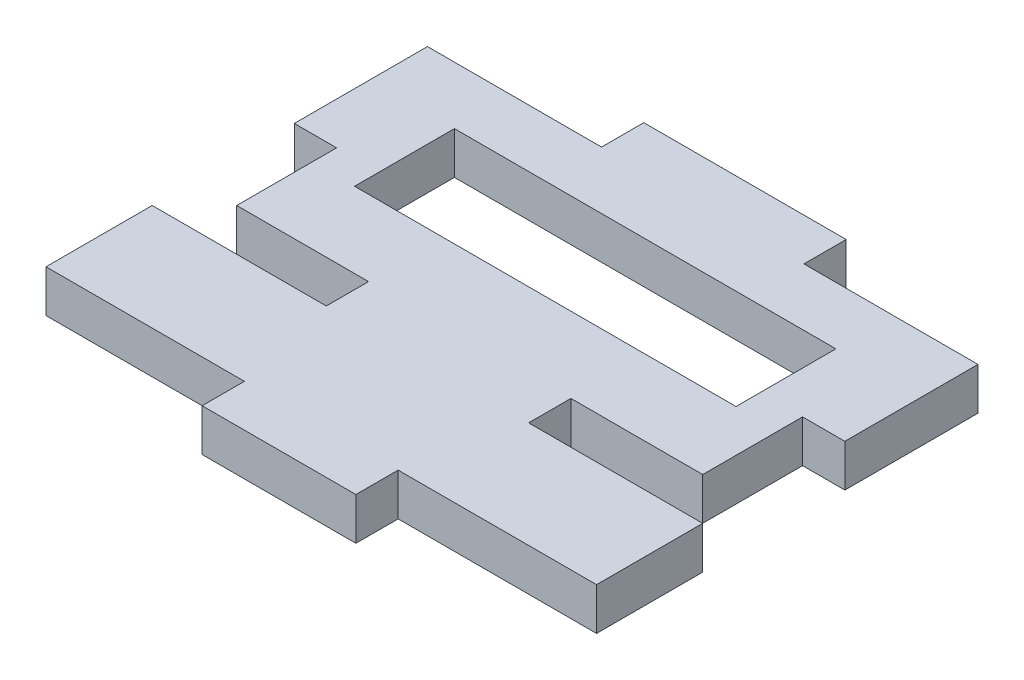
ISO-10303-21;
HEADER;
FILE_DESCRIPTION(('STEP AP214'),'2;1');
FILE_NAME('part.step','',(''),(''),'','','');
FILE_SCHEMA(('AUTOMOTIVE_DESIGN { 1 0 10303 214 1 1 1 1 }'));
ENDSEC;
DATA;
#1=APPLICATION_CONTEXT('core data for automotive mechanical design processes');
#2=APPLICATION_PROTOCOL_DEFINITION('international standard','automotive_design',2000,#1);
#3=PRODUCT_CONTEXT('',#1,'mechanical');
#4=PRODUCT('Part','Part','',(#3));
#5=PRODUCT_RELATED_PRODUCT_CATEGORY('part','',(#4));
#6=PRODUCT_DEFINITION_FORMATION('','',#4);
#7=PRODUCT_DEFINITION_CONTEXT('part definition',#1,'design');
#8=PRODUCT_DEFINITION('design','',#6,#7);
#9=PRODUCT_DEFINITION_SHAPE('','',#8);
#10=(LENGTH_UNIT() NAMED_UNIT(*) SI_UNIT(.MILLI.,.METRE.));
#11=(NAMED_UNIT(*) PLANE_ANGLE_UNIT() SI_UNIT($,.RADIAN.));
#12=(NAMED_UNIT(*) SI_UNIT($,.STERADIAN.) SOLID_ANGLE_UNIT());
#13=UNCERTAINTY_MEASURE_WITH_UNIT(LENGTH_MEASURE(1.E-05),#10,'distance_accuracy_value','');
#14=(GEOMETRIC_REPRESENTATION_CONTEXT(3) GLOBAL_UNCERTAINTY_ASSIGNED_CONTEXT((#13)) GLOBAL_UNIT_ASSIGNED_CONTEXT((#10,
#11,#12)) REPRESENTATION_CONTEXT('',''));
#15=CARTESIAN_POINT('',(0.,0.,0.));
#16=DIRECTION('',(0.,0.,1.));
#17=DIRECTION('',(1.,0.,0.));
#18=AXIS2_PLACEMENT_3D('',#15,#16,#17);
#19=CARTESIAN_POINT('',(0.,3.175,0.));
#20=DIRECTION('',(1.,0.,0.));
#21=DIRECTION('',(0.,0.,-1.));
#22=AXIS2_PLACEMENT_3D('',#19,#20,#21);
#23=PLANE('',#22);
#24=DIRECTION('',(0.,0.,1.));
#25=VECTOR('',#24,1.);
#26=CARTESIAN_POINT('',(0.,3.175,0.));
#27=LINE('',#26,#25);
#28=CARTESIAN_POINT('',(0.,3.175,-11.1499999999999));
#29=VERTEX_POINT('',#28);
#30=CARTESIAN_POINT('',(0.,3.175,-3.17500000000007));
#31=VERTEX_POINT('',#30);
#32=EDGE_CURVE('E414',#29,#31,#27,.T.);
#33=ORIENTED_EDGE('',*,*,#32,.F.);
#34=DIRECTION('',(0.,1.,0.));
#35=VECTOR('',#34,1.);
#36=CARTESIAN_POINT('',(0.,0.,-11.1499999999999));
#37=LINE('',#36,#35);
#38=CARTESIAN_POINT('',(0.,0.,-11.1499999999999));
#39=VERTEX_POINT('',#38);
#40=EDGE_CURVE('E318',#39,#29,#37,.T.);
#41=ORIENTED_EDGE('',*,*,#40,.F.);
#42=DIRECTION('',(0.,0.,1.));
#43=VECTOR('',#42,1.);
#44=CARTESIAN_POINT('',(0.,0.,0.));
#45=LINE('',#44,#43);
#46=CARTESIAN_POINT('',(0.,0.,-3.17500000000007));
#47=VERTEX_POINT('',#46);
#48=EDGE_CURVE('E407',#39,#47,#45,.T.);
#49=ORIENTED_EDGE('',*,*,#48,.T.);
#50=DIRECTION('',(0.,1.,0.));
#51=VECTOR('',#50,1.);
#52=CARTESIAN_POINT('',(0.,0.,-3.17500000000007));
#53=LINE('',#52,#51);
#54=EDGE_CURVE('E285',#47,#31,#53,.T.);
#55=ORIENTED_EDGE('',*,*,#54,.T.);
#56=EDGE_LOOP('',(#33,#41,#49,#55));
#57=FACE_BOUND('',#56,.T.);
#58=ADVANCED_FACE('F32',(#57),#23,.F.);
#59=CARTESIAN_POINT('',(41.35,3.175,0.));
#60=DIRECTION('',(-1.,0.,0.));
#61=DIRECTION('',(0.,0.,1.));
#62=AXIS2_PLACEMENT_3D('',#59,#60,#61);
#63=PLANE('',#62);
#64=DIRECTION('',(0.,0.,-1.));
#65=VECTOR('',#64,1.);
#66=CARTESIAN_POINT('',(41.35,3.175,0.));
#67=LINE('',#66,#65);
#68=CARTESIAN_POINT('',(41.35,3.175,-21.8250000000001));
#69=VERTEX_POINT('',#68);
#70=CARTESIAN_POINT('',(41.35,3.175,-31.825));
#71=VERTEX_POINT('',#70);
#72=EDGE_CURVE('E421',#69,#71,#67,.T.);
#73=ORIENTED_EDGE('',*,*,#72,.F.);
#74=DIRECTION('',(0.,1.,0.));
#75=VECTOR('',#74,1.);
#76=CARTESIAN_POINT('',(41.35,0.,-21.8250000000001));
#77=LINE('',#76,#75);
#78=CARTESIAN_POINT('',(41.35,0.,-21.8250000000001));
#79=VERTEX_POINT('',#78);
#80=EDGE_CURVE('E264',#79,#69,#77,.T.);
#81=ORIENTED_EDGE('',*,*,#80,.F.);
#82=DIRECTION('',(0.,0.,-1.));
#83=VECTOR('',#82,1.);
#84=CARTESIAN_POINT('',(41.35,0.,0.));
#85=LINE('',#84,#83);
#86=CARTESIAN_POINT('',(41.35,0.,-31.825));
#87=VERTEX_POINT('',#86);
#88=EDGE_CURVE('E429',#79,#87,#85,.T.);
#89=ORIENTED_EDGE('',*,*,#88,.T.);
#90=DIRECTION('',(0.,1.,0.));
#91=VECTOR('',#90,1.);
#92=CARTESIAN_POINT('',(41.35,0.,-31.825));
#93=LINE('',#92,#91);
#94=EDGE_CURVE('E362',#87,#71,#93,.T.);
#95=ORIENTED_EDGE('',*,*,#94,.T.);
#96=EDGE_LOOP('',(#73,#81,#89,#95));
#97=FACE_BOUND('',#96,.T.);
#98=ADVANCED_FACE('F466',(#97),#63,.F.);
#99=CARTESIAN_POINT('',(0.,0.,-31.825));
#100=VERTEX_POINT('',#99);
#101=CARTESIAN_POINT('',(0.,0.,-21.825));
#102=VERTEX_POINT('',#101);
#103=EDGE_CURVE('E426',#100,#102,#45,.T.);
#104=ORIENTED_EDGE('',*,*,#103,.T.);
#105=DIRECTION('',(0.,1.,0.));
#106=VECTOR('',#105,1.);
#107=CARTESIAN_POINT('',(0.,0.,-21.825));
#108=LINE('',#107,#106);
#109=CARTESIAN_POINT('',(0.,3.175,-21.825));
#110=VERTEX_POINT('',#109);
#111=EDGE_CURVE('E320',#102,#110,#108,.T.);
#112=ORIENTED_EDGE('',*,*,#111,.T.);
#113=CARTESIAN_POINT('',(0.,3.175,-31.825));
#114=VERTEX_POINT('',#113);
#115=EDGE_CURVE('E417',#114,#110,#27,.T.);
#116=ORIENTED_EDGE('',*,*,#115,.F.);
#117=DIRECTION('',(0.,1.,0.));
#118=VECTOR('',#117,1.);
#119=CARTESIAN_POINT('',(0.,0.,-31.825));
#120=LINE('',#119,#118);
#121=EDGE_CURVE('E335',#100,#114,#120,.T.);
#122=ORIENTED_EDGE('',*,*,#121,.F.);
#123=EDGE_LOOP('',(#104,#112,#116,#122));
#124=FACE_BOUND('',#123,.T.);
#125=ADVANCED_FACE('F34',(#124),#23,.F.);
#126=CARTESIAN_POINT('',(0.,3.175,0.));
#127=DIRECTION('',(0.,0.,-1.));
#128=DIRECTION('',(-1.,0.,0.));
#129=AXIS2_PLACEMENT_3D('',#126,#127,#128);
#130=PLANE('',#129);
#131=DIRECTION('',(1.,0.,0.));
#132=VECTOR('',#131,1.);
#133=CARTESIAN_POINT('',(0.,3.175,0.));
#134=LINE('',#133,#132);
#135=CARTESIAN_POINT('',(14.9,3.175,0.));
#136=VERTEX_POINT('',#135);
#137=CARTESIAN_POINT('',(26.45,3.175,0.));
#138=VERTEX_POINT('',#137);
#139=EDGE_CURVE('E418',#136,#138,#134,.T.);
#140=ORIENTED_EDGE('',*,*,#139,.F.);
#141=DIRECTION('',(0.,1.,0.));
#142=VECTOR('',#141,1.);
#143=CARTESIAN_POINT('',(14.9,0.,0.));
#144=LINE('',#143,#142);
#145=CARTESIAN_POINT('',(14.9,0.,0.));
#146=VERTEX_POINT('',#145);
#147=EDGE_CURVE('E255',#146,#136,#144,.T.);
#148=ORIENTED_EDGE('',*,*,#147,.F.);
#149=DIRECTION('',(1.,0.,0.));
#150=VECTOR('',#149,1.);
#151=CARTESIAN_POINT('',(0.,0.,0.));
#152=LINE('',#151,#150);
#153=CARTESIAN_POINT('',(26.45,0.,0.));
#154=VERTEX_POINT('',#153);
#155=EDGE_CURVE('E427',#146,#154,#152,.T.);
#156=ORIENTED_EDGE('',*,*,#155,.T.);
#157=DIRECTION('',(0.,1.,0.));
#158=VECTOR('',#157,1.);
#159=CARTESIAN_POINT('',(26.45,0.,0.));
#160=LINE('',#159,#158);
#161=EDGE_CURVE('E359',#154,#138,#160,.T.);
#162=ORIENTED_EDGE('',*,*,#161,.T.);
#163=EDGE_LOOP('',(#140,#148,#156,#162));
#164=FACE_BOUND('',#163,.T.);
#165=ADVANCED_FACE('F491',(#164),#130,.F.);
#166=CARTESIAN_POINT('',(41.35,0.,-3.17500000000007));
#167=VERTEX_POINT('',#166);
#168=CARTESIAN_POINT('',(41.35,0.,-11.15));
#169=VERTEX_POINT('',#168);
#170=EDGE_CURVE('E431',#167,#169,#85,.T.);
#171=ORIENTED_EDGE('',*,*,#170,.T.);
#172=DIRECTION('',(0.,1.,0.));
#173=VECTOR('',#172,1.);
#174=CARTESIAN_POINT('',(41.35,0.,-11.15));
#175=LINE('',#174,#173);
#176=CARTESIAN_POINT('',(41.35,3.175,-11.15));
#177=VERTEX_POINT('',#176);
#178=EDGE_CURVE('E266',#169,#177,#175,.T.);
#179=ORIENTED_EDGE('',*,*,#178,.T.);
#180=CARTESIAN_POINT('',(41.35,3.175,-3.17500000000007));
#181=VERTEX_POINT('',#180);
#182=EDGE_CURVE('E41',#181,#177,#67,.T.);
#183=ORIENTED_EDGE('',*,*,#182,.F.);
#184=DIRECTION('',(0.,1.,0.));
#185=VECTOR('',#184,1.);
#186=CARTESIAN_POINT('',(41.35,0.,-3.17500000000007));
#187=LINE('',#186,#185);
#188=EDGE_CURVE('E373',#167,#181,#187,.T.);
#189=ORIENTED_EDGE('',*,*,#188,.F.);
#190=EDGE_LOOP('',(#171,#179,#183,#189));
#191=FACE_BOUND('',#190,.T.);
#192=ADVANCED_FACE('F488',(#191),#63,.F.);
#193=CARTESIAN_POINT('',(0.,3.175,-35.));
#194=DIRECTION('',(0.,0.,1.));
#195=DIRECTION('',(1.,0.,0.));
#196=AXIS2_PLACEMENT_3D('',#193,#194,#195);
#197=PLANE('',#196);
#198=DIRECTION('',(-1.,0.,0.));
#199=VECTOR('',#198,1.);
#200=CARTESIAN_POINT('',(0.,3.175,-35.));
#201=LINE('',#200,#199);
#202=CARTESIAN_POINT('',(28.275,3.175,-35.));
#203=VERTEX_POINT('',#202);
#204=CARTESIAN_POINT('',(13.075,3.175,-35.));
#205=VERTEX_POINT('',#204);
#206=EDGE_CURVE('E11',#203,#205,#201,.T.);
#207=ORIENTED_EDGE('',*,*,#206,.F.);
#208=DIRECTION('',(0.,1.,0.));
#209=VECTOR('',#208,1.);
#210=CARTESIAN_POINT('',(28.275,0.,-35.));
#211=LINE('',#210,#209);
#212=CARTESIAN_POINT('',(28.275,0.,-35.));
#213=VERTEX_POINT('',#212);
#214=EDGE_CURVE('E339',#213,#203,#211,.T.);
#215=ORIENTED_EDGE('',*,*,#214,.F.);
#216=DIRECTION('',(-1.,0.,0.));
#217=VECTOR('',#216,1.);
#218=CARTESIAN_POINT('',(0.,0.,-35.));
#219=LINE('',#218,#217);
#220=CARTESIAN_POINT('',(13.075,0.,-35.));
#221=VERTEX_POINT('',#220);
#222=EDGE_CURVE('E36',#213,#221,#219,.T.);
#223=ORIENTED_EDGE('',*,*,#222,.T.);
#224=DIRECTION('',(0.,1.,0.));
#225=VECTOR('',#224,1.);
#226=CARTESIAN_POINT('',(13.075,0.,-35.));
#227=LINE('',#226,#225);
#228=EDGE_CURVE('E341',#221,#205,#227,.T.);
#229=ORIENTED_EDGE('',*,*,#228,.T.);
#230=EDGE_LOOP('',(#207,#215,#223,#229));
#231=FACE_BOUND('',#230,.T.);
#232=ADVANCED_FACE('F443',(#231),#197,.F.);
#233=CARTESIAN_POINT('',(0.,3.175,0.));
#234=DIRECTION('',(0.,-1.,0.));
#235=DIRECTION('',(0.,0.,-1.));
#236=AXIS2_PLACEMENT_3D('',#233,#234,#235);
#237=PLANE('',#236);
#238=DIRECTION('',(-1.,0.,0.));
#239=VECTOR('',#238,1.);
#240=CARTESIAN_POINT('',(35.,3.175,-27.5));
#241=LINE('',#240,#239);
#242=CARTESIAN_POINT('',(35.,3.175,-27.5));
#243=VERTEX_POINT('',#242);
#244=CARTESIAN_POINT('',(6.35,3.175,-27.5));
#245=VERTEX_POINT('',#244);
#246=EDGE_CURVE('E397',#243,#245,#241,.T.);
#247=ORIENTED_EDGE('',*,*,#246,.F.);
#248=DIRECTION('',(0.,0.,-1.));
#249=VECTOR('',#248,1.);
#250=CARTESIAN_POINT('',(35.,3.175,-27.5));
#251=LINE('',#250,#249);
#252=CARTESIAN_POINT('',(35.,3.175,-20.));
#253=VERTEX_POINT('',#252);
#254=EDGE_CURVE('E344',#253,#243,#251,.T.);
#255=ORIENTED_EDGE('',*,*,#254,.F.);
#256=DIRECTION('',(1.,0.,0.));
#257=VECTOR('',#256,1.);
#258=CARTESIAN_POINT('',(35.,3.175,-20.));
#259=LINE('',#258,#257);
#260=CARTESIAN_POINT('',(6.35,3.175,-20.));
#261=VERTEX_POINT('',#260);
#262=EDGE_CURVE('E386',#261,#253,#259,.T.);
#263=ORIENTED_EDGE('',*,*,#262,.F.);
#264=DIRECTION('',(0.,0.,1.));
#265=VECTOR('',#264,1.);
#266=CARTESIAN_POINT('',(6.35,3.175,-27.5));
#267=LINE('',#266,#265);
#268=EDGE_CURVE('E400',#245,#261,#267,.T.);
#269=ORIENTED_EDGE('',*,*,#268,.F.);
#270=EDGE_LOOP('',(#247,#255,#263,#269));
#271=FACE_BOUND('',#270,.T.);
#272=DIRECTION('',(0.,0.,-1.));
#273=VECTOR('',#272,1.);
#274=CARTESIAN_POINT('',(13.075,3.175,-14.3249999999998));
#275=LINE('',#274,#273);
#276=CARTESIAN_POINT('',(13.075,3.175,-11.1499999999998));
#277=VERTEX_POINT('',#276);
#278=CARTESIAN_POINT('',(13.075,3.175,-14.3249999999998));
#279=VERTEX_POINT('',#278);
#280=EDGE_CURVE('E263',#277,#279,#275,.T.);
#281=ORIENTED_EDGE('',*,*,#280,.F.);
#282=DIRECTION('',(1.,0.,0.));
#283=VECTOR('',#282,1.);
#284=CARTESIAN_POINT('',(13.075,3.175,-11.1499999999998));
#285=LINE('',#284,#283);
#286=EDGE_CURVE('E293',#29,#277,#285,.T.);
#287=ORIENTED_EDGE('',*,*,#286,.F.);
#288=ORIENTED_EDGE('',*,*,#32,.T.);
#289=DIRECTION('',(-1.,0.,0.));
#290=VECTOR('',#289,1.);
#291=CARTESIAN_POINT('',(14.9,3.175,-3.17500000000007));
#292=LINE('',#291,#290);
#293=CARTESIAN_POINT('',(14.9,3.175,-3.17500000000007));
#294=VERTEX_POINT('',#293);
#295=EDGE_CURVE('E276',#294,#31,#292,.T.);
#296=ORIENTED_EDGE('',*,*,#295,.F.);
#297=DIRECTION('',(0.,0.,-1.));
#298=VECTOR('',#297,1.);
#299=CARTESIAN_POINT('',(14.9,3.175,-3.17500000000007));
#300=LINE('',#299,#298);
#301=EDGE_CURVE('E280',#136,#294,#300,.T.);
#302=ORIENTED_EDGE('',*,*,#301,.F.);
#303=ORIENTED_EDGE('',*,*,#139,.T.);
#304=DIRECTION('',(0.,0.,1.));
#305=VECTOR('',#304,1.);
#306=CARTESIAN_POINT('',(26.45,3.175,0.));
#307=LINE('',#306,#305);
#308=CARTESIAN_POINT('',(26.45,3.175,-3.17500000000007));
#309=VERTEX_POINT('',#308);
#310=EDGE_CURVE('E370',#309,#138,#307,.T.);
#311=ORIENTED_EDGE('',*,*,#310,.F.);
#312=DIRECTION('',(-1.,0.,0.));
#313=VECTOR('',#312,1.);
#314=CARTESIAN_POINT('',(41.35,3.175,-3.17500000000007));
#315=LINE('',#314,#313);
#316=EDGE_CURVE('E317',#181,#309,#315,.T.);
#317=ORIENTED_EDGE('',*,*,#316,.F.);
#318=ORIENTED_EDGE('',*,*,#182,.T.);
#319=DIRECTION('',(1.,0.,0.));
#320=VECTOR('',#319,1.);
#321=CARTESIAN_POINT('',(28.275,3.175,-11.1499999999999));
#322=LINE('',#321,#320);
#323=CARTESIAN_POINT('',(28.275,3.175,-11.1499999999999));
#324=VERTEX_POINT('',#323);
#325=EDGE_CURVE('E245',#324,#177,#322,.T.);
#326=ORIENTED_EDGE('',*,*,#325,.F.);
#327=DIRECTION('',(0.,0.,1.));
#328=VECTOR('',#327,1.);
#329=CARTESIAN_POINT('',(28.275,3.175,-14.3249999999998));
#330=LINE('',#329,#328);
#331=CARTESIAN_POINT('',(28.275,3.175,-14.3249999999998));
#332=VERTEX_POINT('',#331);
#333=EDGE_CURVE('E257',#332,#324,#330,.T.);
#334=ORIENTED_EDGE('',*,*,#333,.F.);
#335=DIRECTION('',(-1.,0.,0.));
#336=VECTOR('',#335,1.);
#337=CARTESIAN_POINT('',(38.1750000000003,3.175,-14.3249999999999));
#338=LINE('',#337,#336);
#339=CARTESIAN_POINT('',(38.1750000000003,3.175,-14.3249999999999));
#340=VERTEX_POINT('',#339);
#341=EDGE_CURVE('E254',#340,#332,#338,.T.);
#342=ORIENTED_EDGE('',*,*,#341,.F.);
#343=DIRECTION('',(0.,0.,1.));
#344=VECTOR('',#343,1.);
#345=CARTESIAN_POINT('',(38.1750000000003,3.175,-21.8250000000001));
#346=LINE('',#345,#344);
#347=CARTESIAN_POINT('',(38.1750000000003,3.175,-21.8250000000001));
#348=VERTEX_POINT('',#347);
#349=EDGE_CURVE('E226',#348,#340,#346,.T.);
#350=ORIENTED_EDGE('',*,*,#349,.F.);
#351=DIRECTION('',(-1.,0.,0.));
#352=VECTOR('',#351,1.);
#353=CARTESIAN_POINT('',(38.1750000000003,3.175,-21.8250000000001));
#354=LINE('',#353,#352);
#355=EDGE_CURVE('E242',#69,#348,#354,.T.);
#356=ORIENTED_EDGE('',*,*,#355,.F.);
#357=ORIENTED_EDGE('',*,*,#72,.T.);
#358=DIRECTION('',(1.,0.,0.));
#359=VECTOR('',#358,1.);
#360=CARTESIAN_POINT('',(28.275,3.175,-31.825));
#361=LINE('',#360,#359);
#362=CARTESIAN_POINT('',(28.275,3.175,-31.825));
#363=VERTEX_POINT('',#362);
#364=EDGE_CURVE('E352',#363,#71,#361,.T.);
#365=ORIENTED_EDGE('',*,*,#364,.F.);
#366=DIRECTION('',(0.,0.,1.));
#367=VECTOR('',#366,1.);
#368=CARTESIAN_POINT('',(28.275,3.175,-31.825));
#369=LINE('',#368,#367);
#370=EDGE_CURVE('E356',#203,#363,#369,.T.);
#371=ORIENTED_EDGE('',*,*,#370,.F.);
#372=ORIENTED_EDGE('',*,*,#206,.T.);
#373=DIRECTION('',(0.,0.,-1.));
#374=VECTOR('',#373,1.);
#375=CARTESIAN_POINT('',(13.075,3.175,-35.));
#376=LINE('',#375,#374);
#377=CARTESIAN_POINT('',(13.075,3.175,-31.825));
#378=VERTEX_POINT('',#377);
#379=EDGE_CURVE('E332',#378,#205,#376,.T.);
#380=ORIENTED_EDGE('',*,*,#379,.F.);
#381=DIRECTION('',(1.,0.,0.));
#382=VECTOR('',#381,1.);
#383=CARTESIAN_POINT('',(0.,3.175,-31.825));
#384=LINE('',#383,#382);
#385=EDGE_CURVE('E336',#114,#378,#384,.T.);
#386=ORIENTED_EDGE('',*,*,#385,.F.);
#387=ORIENTED_EDGE('',*,*,#115,.T.);
#388=DIRECTION('',(-1.,0.,0.));
#389=VECTOR('',#388,1.);
#390=CARTESIAN_POINT('',(3.17500000000027,3.175,-21.825));
#391=LINE('',#390,#389);
#392=CARTESIAN_POINT('',(3.17500000000027,3.175,-21.825));
#393=VERTEX_POINT('',#392);
#394=EDGE_CURVE('E311',#393,#110,#391,.T.);
#395=ORIENTED_EDGE('',*,*,#394,.F.);
#396=DIRECTION('',(0.,0.,-1.));
#397=VECTOR('',#396,1.);
#398=CARTESIAN_POINT('',(3.17500000000027,3.175,-21.825));
#399=LINE('',#398,#397);
#400=CARTESIAN_POINT('',(3.17500000000033,3.175,-14.3249999999998));
#401=VERTEX_POINT('',#400);
#402=EDGE_CURVE('E308',#401,#393,#399,.T.);
#403=ORIENTED_EDGE('',*,*,#402,.F.);
#404=DIRECTION('',(-1.,0.,0.));
#405=VECTOR('',#404,1.);
#406=CARTESIAN_POINT('',(3.17500000000033,3.175,-14.3249999999998));
#407=LINE('',#406,#405);
#408=EDGE_CURVE('E305',#279,#401,#407,.T.);
#409=ORIENTED_EDGE('',*,*,#408,.F.);
#410=EDGE_LOOP('',(#281,#287,#288,#296,#302,#303,#311,#317,#318,#326,#334,#342,#350,#356,#357,
#365,#371,#372,#380,#386,#387,#395,#403,#409));
#411=FACE_BOUND('',#410,.T.);
#412=ADVANCED_FACE('F457',(#271,#411),#237,.F.);
#413=CARTESIAN_POINT('',(0.,0.,0.));
#414=DIRECTION('',(0.,-1.,0.));
#415=DIRECTION('',(0.,0.,-1.));
#416=AXIS2_PLACEMENT_3D('',#413,#414,#415);
#417=PLANE('',#416);
#418=DIRECTION('',(1.,0.,0.));
#419=VECTOR('',#418,1.);
#420=CARTESIAN_POINT('',(13.075,0.,-11.1499999999998));
#421=LINE('',#420,#419);
#422=CARTESIAN_POINT('',(13.075,0.,-11.1499999999998));
#423=VERTEX_POINT('',#422);
#424=EDGE_CURVE('E300',#39,#423,#421,.T.);
#425=ORIENTED_EDGE('',*,*,#424,.T.);
#426=DIRECTION('',(0.,0.,-1.));
#427=VECTOR('',#426,1.);
#428=CARTESIAN_POINT('',(13.075,0.,-14.3249999999998));
#429=LINE('',#428,#427);
#430=CARTESIAN_POINT('',(13.075,0.,-14.3249999999998));
#431=VERTEX_POINT('',#430);
#432=EDGE_CURVE('E289',#423,#431,#429,.T.);
#433=ORIENTED_EDGE('',*,*,#432,.T.);
#434=DIRECTION('',(-1.,0.,0.));
#435=VECTOR('',#434,1.);
#436=CARTESIAN_POINT('',(3.17500000000033,0.,-14.3249999999998));
#437=LINE('',#436,#435);
#438=CARTESIAN_POINT('',(3.17500000000033,0.,-14.3249999999998));
#439=VERTEX_POINT('',#438);
#440=EDGE_CURVE('E292',#431,#439,#437,.T.);
#441=ORIENTED_EDGE('',*,*,#440,.T.);
#442=DIRECTION('',(0.,0.,-1.));
#443=VECTOR('',#442,1.);
#444=CARTESIAN_POINT('',(3.17500000000027,0.,-21.825));
#445=LINE('',#444,#443);
#446=CARTESIAN_POINT('',(3.17500000000027,0.,-21.825));
#447=VERTEX_POINT('',#446);
#448=EDGE_CURVE('E49',#439,#447,#445,.T.);
#449=ORIENTED_EDGE('',*,*,#448,.T.);
#450=DIRECTION('',(-1.,0.,0.));
#451=VECTOR('',#450,1.);
#452=CARTESIAN_POINT('',(3.17500000000027,0.,-21.825));
#453=LINE('',#452,#451);
#454=EDGE_CURVE('E297',#447,#102,#453,.T.);
#455=ORIENTED_EDGE('',*,*,#454,.T.);
#456=ORIENTED_EDGE('',*,*,#103,.F.);
#457=DIRECTION('',(1.,0.,0.));
#458=VECTOR('',#457,1.);
#459=CARTESIAN_POINT('',(0.,0.,-31.825));
#460=LINE('',#459,#458);
#461=CARTESIAN_POINT('',(13.075,0.,-31.825));
#462=VERTEX_POINT('',#461);
#463=EDGE_CURVE('E328',#100,#462,#460,.T.);
#464=ORIENTED_EDGE('',*,*,#463,.T.);
#465=DIRECTION('',(0.,0.,-1.));
#466=VECTOR('',#465,1.);
#467=CARTESIAN_POINT('',(13.075,0.,-35.));
#468=LINE('',#467,#466);
#469=EDGE_CURVE('E331',#462,#221,#468,.T.);
#470=ORIENTED_EDGE('',*,*,#469,.T.);
#471=ORIENTED_EDGE('',*,*,#222,.F.);
#472=DIRECTION('',(0.,0.,1.));
#473=VECTOR('',#472,1.);
#474=CARTESIAN_POINT('',(28.275,0.,-31.825));
#475=LINE('',#474,#473);
#476=CARTESIAN_POINT('',(28.275,0.,-31.825));
#477=VERTEX_POINT('',#476);
#478=EDGE_CURVE('E348',#213,#477,#475,.T.);
#479=ORIENTED_EDGE('',*,*,#478,.T.);
#480=DIRECTION('',(1.,0.,0.));
#481=VECTOR('',#480,1.);
#482=CARTESIAN_POINT('',(28.275,0.,-31.825));
#483=LINE('',#482,#481);
#484=EDGE_CURVE('E351',#477,#87,#483,.T.);
#485=ORIENTED_EDGE('',*,*,#484,.T.);
#486=ORIENTED_EDGE('',*,*,#88,.F.);
#487=DIRECTION('',(-1.,0.,0.));
#488=VECTOR('',#487,1.);
#489=CARTESIAN_POINT('',(38.1750000000003,0.,-21.8250000000001));
#490=LINE('',#489,#488);
#491=CARTESIAN_POINT('',(38.1750000000003,0.,-21.8250000000001));
#492=VERTEX_POINT('',#491);
#493=EDGE_CURVE('E231',#79,#492,#490,.T.);
#494=ORIENTED_EDGE('',*,*,#493,.T.);
#495=DIRECTION('',(0.,0.,1.));
#496=VECTOR('',#495,1.);
#497=CARTESIAN_POINT('',(38.1750000000003,0.,-21.8250000000001));
#498=LINE('',#497,#496);
#499=CARTESIAN_POINT('',(38.1750000000003,0.,-14.3249999999999));
#500=VERTEX_POINT('',#499);
#501=EDGE_CURVE('E223',#492,#500,#498,.T.);
#502=ORIENTED_EDGE('',*,*,#501,.T.);
#503=DIRECTION('',(-1.,0.,0.));
#504=VECTOR('',#503,1.);
#505=CARTESIAN_POINT('',(38.1750000000003,0.,-14.3249999999999));
#506=LINE('',#505,#504);
#507=CARTESIAN_POINT('',(28.275,0.,-14.3249999999998));
#508=VERTEX_POINT('',#507);
#509=EDGE_CURVE('E234',#500,#508,#506,.T.);
#510=ORIENTED_EDGE('',*,*,#509,.T.);
#511=DIRECTION('',(0.,0.,1.));
#512=VECTOR('',#511,1.);
#513=CARTESIAN_POINT('',(28.275,0.,-14.3249999999998));
#514=LINE('',#513,#512);
#515=CARTESIAN_POINT('',(28.275,0.,-11.1499999999999));
#516=VERTEX_POINT('',#515);
#517=EDGE_CURVE('E57',#508,#516,#514,.T.);
#518=ORIENTED_EDGE('',*,*,#517,.T.);
#519=DIRECTION('',(1.,0.,0.));
#520=VECTOR('',#519,1.);
#521=CARTESIAN_POINT('',(28.275,0.,-11.1499999999999));
#522=LINE('',#521,#520);
#523=EDGE_CURVE('E249',#516,#169,#522,.T.);
#524=ORIENTED_EDGE('',*,*,#523,.T.);
#525=ORIENTED_EDGE('',*,*,#170,.F.);
#526=DIRECTION('',(-1.,0.,0.));
#527=VECTOR('',#526,1.);
#528=CARTESIAN_POINT('',(41.35,0.,-3.17500000000007));
#529=LINE('',#528,#527);
#530=CARTESIAN_POINT('',(26.45,0.,-3.17500000000007));
#531=VERTEX_POINT('',#530);
#532=EDGE_CURVE('E366',#167,#531,#529,.T.);
#533=ORIENTED_EDGE('',*,*,#532,.T.);
#534=DIRECTION('',(0.,0.,1.));
#535=VECTOR('',#534,1.);
#536=CARTESIAN_POINT('',(26.45,0.,0.));
#537=LINE('',#536,#535);
#538=EDGE_CURVE('E369',#531,#154,#537,.T.);
#539=ORIENTED_EDGE('',*,*,#538,.T.);
#540=ORIENTED_EDGE('',*,*,#155,.F.);
#541=DIRECTION('',(0.,0.,-1.));
#542=VECTOR('',#541,1.);
#543=CARTESIAN_POINT('',(14.9,0.,-3.17500000000007));
#544=LINE('',#543,#542);
#545=CARTESIAN_POINT('',(14.9,0.,-3.17500000000007));
#546=VERTEX_POINT('',#545);
#547=EDGE_CURVE('E272',#146,#546,#544,.T.);
#548=ORIENTED_EDGE('',*,*,#547,.T.);
#549=DIRECTION('',(-1.,0.,0.));
#550=VECTOR('',#549,1.);
#551=CARTESIAN_POINT('',(14.9,0.,-3.17500000000007));
#552=LINE('',#551,#550);
#553=EDGE_CURVE('E275',#546,#47,#552,.T.);
#554=ORIENTED_EDGE('',*,*,#553,.T.);
#555=ORIENTED_EDGE('',*,*,#48,.F.);
#556=EDGE_LOOP('',(#425,#433,#441,#449,#455,#456,#464,#470,#471,#479,#485,#486,#494,#502,#510,
#518,#524,#525,#533,#539,#540,#548,#554,#555));
#557=FACE_BOUND('',#556,.T.);
#558=DIRECTION('',(0.,0.,-1.));
#559=VECTOR('',#558,1.);
#560=CARTESIAN_POINT('',(35.,0.,-27.5));
#561=LINE('',#560,#559);
#562=CARTESIAN_POINT('',(35.,0.,-20.));
#563=VERTEX_POINT('',#562);
#564=CARTESIAN_POINT('',(35.,0.,-27.5));
#565=VERTEX_POINT('',#564);
#566=EDGE_CURVE('E382',#563,#565,#561,.T.);
#567=ORIENTED_EDGE('',*,*,#566,.T.);
#568=DIRECTION('',(-1.,0.,0.));
#569=VECTOR('',#568,1.);
#570=CARTESIAN_POINT('',(35.,0.,-27.5));
#571=LINE('',#570,#569);
#572=CARTESIAN_POINT('',(6.35,0.,-27.5));
#573=VERTEX_POINT('',#572);
#574=EDGE_CURVE('E385',#565,#573,#571,.T.);
#575=ORIENTED_EDGE('',*,*,#574,.T.);
#576=DIRECTION('',(0.,0.,1.));
#577=VECTOR('',#576,1.);
#578=CARTESIAN_POINT('',(6.35,0.,-27.5));
#579=LINE('',#578,#577);
#580=CARTESIAN_POINT('',(6.35,0.,-20.));
#581=VERTEX_POINT('',#580);
#582=EDGE_CURVE('E389',#573,#581,#579,.T.);
#583=ORIENTED_EDGE('',*,*,#582,.T.);
#584=DIRECTION('',(1.,0.,0.));
#585=VECTOR('',#584,1.);
#586=CARTESIAN_POINT('',(35.,0.,-20.));
#587=LINE('',#586,#585);
#588=EDGE_CURVE('E392',#581,#563,#587,.T.);
#589=ORIENTED_EDGE('',*,*,#588,.T.);
#590=EDGE_LOOP('',(#567,#575,#583,#589));
#591=FACE_BOUND('',#590,.T.);
#592=ADVANCED_FACE('F239',(#557,#591),#417,.T.);
#593=CARTESIAN_POINT('',(35.,0.,-27.5));
#594=DIRECTION('',(1.,0.,0.));
#595=DIRECTION('',(0.,0.,-1.));
#596=AXIS2_PLACEMENT_3D('',#593,#594,#595);
#597=PLANE('',#596);
#598=ORIENTED_EDGE('',*,*,#254,.T.);
#599=DIRECTION('',(0.,1.,0.));
#600=VECTOR('',#599,1.);
#601=CARTESIAN_POINT('',(35.,0.,-27.5));
#602=LINE('',#601,#600);
#603=EDGE_CURVE('E395',#565,#243,#602,.T.);
#604=ORIENTED_EDGE('',*,*,#603,.F.);
#605=ORIENTED_EDGE('',*,*,#566,.F.);
#606=DIRECTION('',(0.,1.,0.));
#607=VECTOR('',#606,1.);
#608=CARTESIAN_POINT('',(35.,0.,-20.));
#609=LINE('',#608,#607);
#610=EDGE_CURVE('E405',#563,#253,#609,.T.);
#611=ORIENTED_EDGE('',*,*,#610,.T.);
#612=EDGE_LOOP('',(#598,#604,#605,#611));
#613=FACE_BOUND('',#612,.T.);
#614=ADVANCED_FACE('F575',(#613),#597,.F.);
#615=CARTESIAN_POINT('',(35.,0.,-20.));
#616=DIRECTION('',(0.,0.,1.));
#617=DIRECTION('',(1.,0.,0.));
#618=AXIS2_PLACEMENT_3D('',#615,#616,#617);
#619=PLANE('',#618);
#620=ORIENTED_EDGE('',*,*,#262,.T.);
#621=ORIENTED_EDGE('',*,*,#610,.F.);
#622=ORIENTED_EDGE('',*,*,#588,.F.);
#623=DIRECTION('',(0.,1.,0.));
#624=VECTOR('',#623,1.);
#625=CARTESIAN_POINT('',(6.35,0.,-20.));
#626=LINE('',#625,#624);
#627=EDGE_CURVE('E408',#581,#261,#626,.T.);
#628=ORIENTED_EDGE('',*,*,#627,.T.);
#629=EDGE_LOOP('',(#620,#621,#622,#628));
#630=FACE_BOUND('',#629,.T.);
#631=ADVANCED_FACE('F571',(#630),#619,.F.);
#632=CARTESIAN_POINT('',(6.35,0.,-27.5));
#633=DIRECTION('',(-1.,0.,0.));
#634=DIRECTION('',(0.,0.,1.));
#635=AXIS2_PLACEMENT_3D('',#632,#633,#634);
#636=PLANE('',#635);
#637=ORIENTED_EDGE('',*,*,#268,.T.);
#638=ORIENTED_EDGE('',*,*,#627,.F.);
#639=ORIENTED_EDGE('',*,*,#582,.F.);
#640=DIRECTION('',(0.,1.,0.));
#641=VECTOR('',#640,1.);
#642=CARTESIAN_POINT('',(6.35,0.,-27.5));
#643=LINE('',#642,#641);
#644=EDGE_CURVE('E410',#573,#245,#643,.T.);
#645=ORIENTED_EDGE('',*,*,#644,.T.);
#646=EDGE_LOOP('',(#637,#638,#639,#645));
#647=FACE_BOUND('',#646,.T.);
#648=ADVANCED_FACE('F574',(#647),#636,.F.);
#649=CARTESIAN_POINT('',(35.,0.,-27.5));
#650=DIRECTION('',(0.,0.,-1.));
#651=DIRECTION('',(-1.,0.,0.));
#652=AXIS2_PLACEMENT_3D('',#649,#650,#651);
#653=PLANE('',#652);
#654=ORIENTED_EDGE('',*,*,#246,.T.);
#655=ORIENTED_EDGE('',*,*,#644,.F.);
#656=ORIENTED_EDGE('',*,*,#574,.F.);
#657=ORIENTED_EDGE('',*,*,#603,.T.);
#658=EDGE_LOOP('',(#654,#655,#656,#657));
#659=FACE_BOUND('',#658,.T.);
#660=ADVANCED_FACE('F560',(#659),#653,.F.);
#661=CARTESIAN_POINT('',(13.075,0.,-35.));
#662=DIRECTION('',(1.,0.,0.));
#663=DIRECTION('',(0.,0.,-1.));
#664=AXIS2_PLACEMENT_3D('',#661,#662,#663);
#665=PLANE('',#664);
#666=ORIENTED_EDGE('',*,*,#379,.T.);
#667=ORIENTED_EDGE('',*,*,#228,.F.);
#668=ORIENTED_EDGE('',*,*,#469,.F.);
#669=DIRECTION('',(0.,1.,0.));
#670=VECTOR('',#669,1.);
#671=CARTESIAN_POINT('',(13.075,0.,-31.825));
#672=LINE('',#671,#670);
#673=EDGE_CURVE('E345',#462,#378,#672,.T.);
#674=ORIENTED_EDGE('',*,*,#673,.T.);
#675=EDGE_LOOP('',(#666,#667,#668,#674));
#676=FACE_BOUND('',#675,.T.);
#677=ADVANCED_FACE('F447',(#676),#665,.F.);
#678=CARTESIAN_POINT('',(0.,0.,-31.825));
#679=DIRECTION('',(0.,0.,1.));
#680=DIRECTION('',(1.,0.,0.));
#681=AXIS2_PLACEMENT_3D('',#678,#679,#680);
#682=PLANE('',#681);
#683=ORIENTED_EDGE('',*,*,#385,.T.);
#684=ORIENTED_EDGE('',*,*,#673,.F.);
#685=ORIENTED_EDGE('',*,*,#463,.F.);
#686=ORIENTED_EDGE('',*,*,#121,.T.);
#687=EDGE_LOOP('',(#683,#684,#685,#686));
#688=FACE_BOUND('',#687,.T.);
#689=ADVANCED_FACE('F449',(#688),#682,.F.);
#690=CARTESIAN_POINT('',(28.275,0.,-31.825));
#691=DIRECTION('',(-1.,0.,0.));
#692=DIRECTION('',(0.,0.,1.));
#693=AXIS2_PLACEMENT_3D('',#690,#691,#692);
#694=PLANE('',#693);
#695=ORIENTED_EDGE('',*,*,#370,.T.);
#696=DIRECTION('',(0.,1.,0.));
#697=VECTOR('',#696,1.);
#698=CARTESIAN_POINT('',(28.275,0.,-31.825));
#699=LINE('',#698,#697);
#700=EDGE_CURVE('E355',#477,#363,#699,.T.);
#701=ORIENTED_EDGE('',*,*,#700,.F.);
#702=ORIENTED_EDGE('',*,*,#478,.F.);
#703=ORIENTED_EDGE('',*,*,#214,.T.);
#704=EDGE_LOOP('',(#695,#701,#702,#703));
#705=FACE_BOUND('',#704,.T.);
#706=ADVANCED_FACE('F461',(#705),#694,.F.);
#707=CARTESIAN_POINT('',(28.275,0.,-31.825));
#708=DIRECTION('',(0.,0.,1.));
#709=DIRECTION('',(1.,0.,0.));
#710=AXIS2_PLACEMENT_3D('',#707,#708,#709);
#711=PLANE('',#710);
#712=ORIENTED_EDGE('',*,*,#364,.T.);
#713=ORIENTED_EDGE('',*,*,#94,.F.);
#714=ORIENTED_EDGE('',*,*,#484,.F.);
#715=ORIENTED_EDGE('',*,*,#700,.T.);
#716=EDGE_LOOP('',(#712,#713,#714,#715));
#717=FACE_BOUND('',#716,.T.);
#718=ADVANCED_FACE('F464',(#717),#711,.F.);
#719=CARTESIAN_POINT('',(26.45,0.,0.));
#720=DIRECTION('',(-1.,0.,0.));
#721=DIRECTION('',(0.,0.,1.));
#722=AXIS2_PLACEMENT_3D('',#719,#720,#721);
#723=PLANE('',#722);
#724=ORIENTED_EDGE('',*,*,#310,.T.);
#725=ORIENTED_EDGE('',*,*,#161,.F.);
#726=ORIENTED_EDGE('',*,*,#538,.F.);
#727=DIRECTION('',(0.,1.,0.));
#728=VECTOR('',#727,1.);
#729=CARTESIAN_POINT('',(26.45,0.,-3.17500000000007));
#730=LINE('',#729,#728);
#731=EDGE_CURVE('E379',#531,#309,#730,.T.);
#732=ORIENTED_EDGE('',*,*,#731,.T.);
#733=EDGE_LOOP('',(#724,#725,#726,#732));
#734=FACE_BOUND('',#733,.T.);
#735=ADVANCED_FACE('F529',(#734),#723,.F.);
#736=CARTESIAN_POINT('',(41.35,0.,-3.17500000000007));
#737=DIRECTION('',(0.,0.,-1.));
#738=DIRECTION('',(-1.,0.,0.));
#739=AXIS2_PLACEMENT_3D('',#736,#737,#738);
#740=PLANE('',#739);
#741=ORIENTED_EDGE('',*,*,#316,.T.);
#742=ORIENTED_EDGE('',*,*,#731,.F.);
#743=ORIENTED_EDGE('',*,*,#532,.F.);
#744=ORIENTED_EDGE('',*,*,#188,.T.);
#745=EDGE_LOOP('',(#741,#742,#743,#744));
#746=FACE_BOUND('',#745,.T.);
#747=ADVANCED_FACE('F532',(#746),#740,.F.);
#748=CARTESIAN_POINT('',(14.9,0.,-3.17500000000007));
#749=DIRECTION('',(1.,0.,0.));
#750=DIRECTION('',(0.,0.,-1.));
#751=AXIS2_PLACEMENT_3D('',#748,#749,#750);
#752=PLANE('',#751);
#753=ORIENTED_EDGE('',*,*,#301,.T.);
#754=DIRECTION('',(0.,1.,0.));
#755=VECTOR('',#754,1.);
#756=CARTESIAN_POINT('',(14.9,0.,-3.17500000000007));
#757=LINE('',#756,#755);
#758=EDGE_CURVE('E279',#546,#294,#757,.T.);
#759=ORIENTED_EDGE('',*,*,#758,.F.);
#760=ORIENTED_EDGE('',*,*,#547,.F.);
#761=ORIENTED_EDGE('',*,*,#147,.T.);
#762=EDGE_LOOP('',(#753,#759,#760,#761));
#763=FACE_BOUND('',#762,.T.);
#764=ADVANCED_FACE('F521',(#763),#752,.F.);
#765=CARTESIAN_POINT('',(14.9,0.,-3.17500000000007));
#766=DIRECTION('',(0.,0.,-1.));
#767=DIRECTION('',(-1.,0.,0.));
#768=AXIS2_PLACEMENT_3D('',#765,#766,#767);
#769=PLANE('',#768);
#770=ORIENTED_EDGE('',*,*,#295,.T.);
#771=ORIENTED_EDGE('',*,*,#54,.F.);
#772=ORIENTED_EDGE('',*,*,#553,.F.);
#773=ORIENTED_EDGE('',*,*,#758,.T.);
#774=EDGE_LOOP('',(#770,#771,#772,#773));
#775=FACE_BOUND('',#774,.T.);
#776=ADVANCED_FACE('F480',(#775),#769,.F.);
#777=CARTESIAN_POINT('',(38.1750000000003,0.,-21.8250000000001));
#778=DIRECTION('',(-1.,0.,0.));
#779=DIRECTION('',(0.,0.,1.));
#780=AXIS2_PLACEMENT_3D('',#777,#778,#779);
#781=PLANE('',#780);
#782=ORIENTED_EDGE('',*,*,#349,.T.);
#783=DIRECTION('',(0.,1.,0.));
#784=VECTOR('',#783,1.);
#785=CARTESIAN_POINT('',(38.1750000000003,0.,-14.3249999999999));
#786=LINE('',#785,#784);
#787=EDGE_CURVE('E219',#500,#340,#786,.T.);
#788=ORIENTED_EDGE('',*,*,#787,.F.);
#789=ORIENTED_EDGE('',*,*,#501,.F.);
#790=DIRECTION('',(0.,1.,0.));
#791=VECTOR('',#790,1.);
#792=CARTESIAN_POINT('',(38.1750000000003,0.,-21.8250000000001));
#793=LINE('',#792,#791);
#794=EDGE_CURVE('E261',#492,#348,#793,.T.);
#795=ORIENTED_EDGE('',*,*,#794,.T.);
#796=EDGE_LOOP('',(#782,#788,#789,#795));
#797=FACE_BOUND('',#796,.T.);
#798=ADVANCED_FACE('F221',(#797),#781,.F.);
#799=CARTESIAN_POINT('',(38.1750000000003,0.,-21.8250000000001));
#800=DIRECTION('',(0.,0.,-1.));
#801=DIRECTION('',(-1.,0.,0.));
#802=AXIS2_PLACEMENT_3D('',#799,#800,#801);
#803=PLANE('',#802);
#804=ORIENTED_EDGE('',*,*,#355,.T.);
#805=ORIENTED_EDGE('',*,*,#794,.F.);
#806=ORIENTED_EDGE('',*,*,#493,.F.);
#807=ORIENTED_EDGE('',*,*,#80,.T.);
#808=EDGE_LOOP('',(#804,#805,#806,#807));
#809=FACE_BOUND('',#808,.T.);
#810=ADVANCED_FACE('F469',(#809),#803,.F.);
#811=CARTESIAN_POINT('',(28.275,0.,-11.1499999999999));
#812=DIRECTION('',(0.,0.,1.));
#813=DIRECTION('',(1.,0.,0.));
#814=AXIS2_PLACEMENT_3D('',#811,#812,#813);
#815=PLANE('',#814);
#816=ORIENTED_EDGE('',*,*,#325,.T.);
#817=ORIENTED_EDGE('',*,*,#178,.F.);
#818=ORIENTED_EDGE('',*,*,#523,.F.);
#819=DIRECTION('',(0.,1.,0.));
#820=VECTOR('',#819,1.);
#821=CARTESIAN_POINT('',(28.275,0.,-11.1499999999999));
#822=LINE('',#821,#820);
#823=EDGE_CURVE('E269',#516,#324,#822,.T.);
#824=ORIENTED_EDGE('',*,*,#823,.T.);
#825=EDGE_LOOP('',(#816,#817,#818,#824));
#826=FACE_BOUND('',#825,.T.);
#827=ADVANCED_FACE('F471',(#826),#815,.F.);
#828=CARTESIAN_POINT('',(28.275,0.,-14.3249999999998));
#829=DIRECTION('',(-1.,0.,0.));
#830=DIRECTION('',(0.,0.,1.));
#831=AXIS2_PLACEMENT_3D('',#828,#829,#830);
#832=PLANE('',#831);
#833=ORIENTED_EDGE('',*,*,#333,.T.);
#834=ORIENTED_EDGE('',*,*,#823,.F.);
#835=ORIENTED_EDGE('',*,*,#517,.F.);
#836=DIRECTION('',(0.,1.,0.));
#837=VECTOR('',#836,1.);
#838=CARTESIAN_POINT('',(28.275,0.,-14.3249999999998));
#839=LINE('',#838,#837);
#840=EDGE_CURVE('E230',#508,#332,#839,.T.);
#841=ORIENTED_EDGE('',*,*,#840,.T.);
#842=EDGE_LOOP('',(#833,#834,#835,#841));
#843=FACE_BOUND('',#842,.T.);
#844=ADVANCED_FACE('F477',(#843),#832,.F.);
#845=CARTESIAN_POINT('',(38.1750000000003,0.,-14.3249999999999));
#846=DIRECTION('',(0.,0.,-1.));
#847=DIRECTION('',(-1.,0.,0.));
#848=AXIS2_PLACEMENT_3D('',#845,#846,#847);
#849=PLANE('',#848);
#850=ORIENTED_EDGE('',*,*,#341,.T.);
#851=ORIENTED_EDGE('',*,*,#840,.F.);
#852=ORIENTED_EDGE('',*,*,#509,.F.);
#853=ORIENTED_EDGE('',*,*,#787,.T.);
#854=EDGE_LOOP('',(#850,#851,#852,#853));
#855=FACE_BOUND('',#854,.T.);
#856=ADVANCED_FACE('F235',(#855),#849,.F.);
#857=CARTESIAN_POINT('',(13.075,0.,-14.3249999999998));
#858=DIRECTION('',(1.,0.,0.));
#859=DIRECTION('',(0.,0.,-1.));
#860=AXIS2_PLACEMENT_3D('',#857,#858,#859);
#861=PLANE('',#860);
#862=ORIENTED_EDGE('',*,*,#280,.T.);
#863=DIRECTION('',(0.,1.,0.));
#864=VECTOR('',#863,1.);
#865=CARTESIAN_POINT('',(13.075,0.,-14.3249999999998));
#866=LINE('',#865,#864);
#867=EDGE_CURVE('E302',#431,#279,#866,.T.);
#868=ORIENTED_EDGE('',*,*,#867,.F.);
#869=ORIENTED_EDGE('',*,*,#432,.F.);
#870=DIRECTION('',(0.,1.,0.));
#871=VECTOR('',#870,1.);
#872=CARTESIAN_POINT('',(13.075,0.,-11.1499999999998));
#873=LINE('',#872,#871);
#874=EDGE_CURVE('E315',#423,#277,#873,.T.);
#875=ORIENTED_EDGE('',*,*,#874,.T.);
#876=EDGE_LOOP('',(#862,#868,#869,#875));
#877=FACE_BOUND('',#876,.T.);
#878=ADVANCED_FACE('F510',(#877),#861,.F.);
#879=CARTESIAN_POINT('',(13.075,0.,-11.1499999999998));
#880=DIRECTION('',(0.,0.,1.));
#881=DIRECTION('',(1.,0.,0.));
#882=AXIS2_PLACEMENT_3D('',#879,#880,#881);
#883=PLANE('',#882);
#884=ORIENTED_EDGE('',*,*,#286,.T.);
#885=ORIENTED_EDGE('',*,*,#874,.F.);
#886=ORIENTED_EDGE('',*,*,#424,.F.);
#887=ORIENTED_EDGE('',*,*,#40,.T.);
#888=EDGE_LOOP('',(#884,#885,#886,#887));
#889=FACE_BOUND('',#888,.T.);
#890=ADVANCED_FACE('F547',(#889),#883,.F.);
#891=CARTESIAN_POINT('',(3.17500000000027,0.,-21.825));
#892=DIRECTION('',(0.,0.,-1.));
#893=DIRECTION('',(-1.,0.,0.));
#894=AXIS2_PLACEMENT_3D('',#891,#892,#893);
#895=PLANE('',#894);
#896=ORIENTED_EDGE('',*,*,#394,.T.);
#897=ORIENTED_EDGE('',*,*,#111,.F.);
#898=ORIENTED_EDGE('',*,*,#454,.F.);
#899=DIRECTION('',(0.,1.,0.));
#900=VECTOR('',#899,1.);
#901=CARTESIAN_POINT('',(3.17500000000027,0.,-21.825));
#902=LINE('',#901,#900);
#903=EDGE_CURVE('E323',#447,#393,#902,.T.);
#904=ORIENTED_EDGE('',*,*,#903,.T.);
#905=EDGE_LOOP('',(#896,#897,#898,#904));
#906=FACE_BOUND('',#905,.T.);
#907=ADVANCED_FACE('F500',(#906),#895,.F.);
#908=CARTESIAN_POINT('',(3.17500000000027,0.,-21.825));
#909=DIRECTION('',(1.,0.,0.));
#910=DIRECTION('',(0.,0.,-1.));
#911=AXIS2_PLACEMENT_3D('',#908,#909,#910);
#912=PLANE('',#911);
#913=ORIENTED_EDGE('',*,*,#402,.T.);
#914=ORIENTED_EDGE('',*,*,#903,.F.);
#915=ORIENTED_EDGE('',*,*,#448,.F.);
#916=DIRECTION('',(0.,1.,0.));
#917=VECTOR('',#916,1.);
#918=CARTESIAN_POINT('',(3.17500000000033,0.,-14.3249999999998));
#919=LINE('',#918,#917);
#920=EDGE_CURVE('E325',#439,#401,#919,.T.);
#921=ORIENTED_EDGE('',*,*,#920,.T.);
#922=EDGE_LOOP('',(#913,#914,#915,#921));
#923=FACE_BOUND('',#922,.T.);
#924=ADVANCED_FACE('F504',(#923),#912,.F.);
#925=CARTESIAN_POINT('',(3.17500000000033,0.,-14.3249999999998));
#926=DIRECTION('',(0.,0.,-1.));
#927=DIRECTION('',(-1.,0.,0.));
#928=AXIS2_PLACEMENT_3D('',#925,#926,#927);
#929=PLANE('',#928);
#930=ORIENTED_EDGE('',*,*,#408,.T.);
#931=ORIENTED_EDGE('',*,*,#920,.F.);
#932=ORIENTED_EDGE('',*,*,#440,.F.);
#933=ORIENTED_EDGE('',*,*,#867,.T.);
#934=EDGE_LOOP('',(#930,#931,#932,#933));
#935=FACE_BOUND('',#934,.T.);
#936=ADVANCED_FACE('F507',(#935),#929,.F.);
#937=CLOSED_SHELL('',(#58,#98,#125,#165,#192,#232,#412,#592,#614,#631,#648,#660,#677,#689,#706,
#718,#735,#747,#764,#776,#798,#810,#827,#844,#856,#878,#890,#907,#924,#936));
#938=MANIFOLD_SOLID_BREP('B2',#937);
#939=ADVANCED_BREP_SHAPE_REPRESENTATION('',(#18,#938),#14);
#940=SHAPE_DEFINITION_REPRESENTATION(#9,#939);
ENDSEC;
END-ISO-10303-21;
